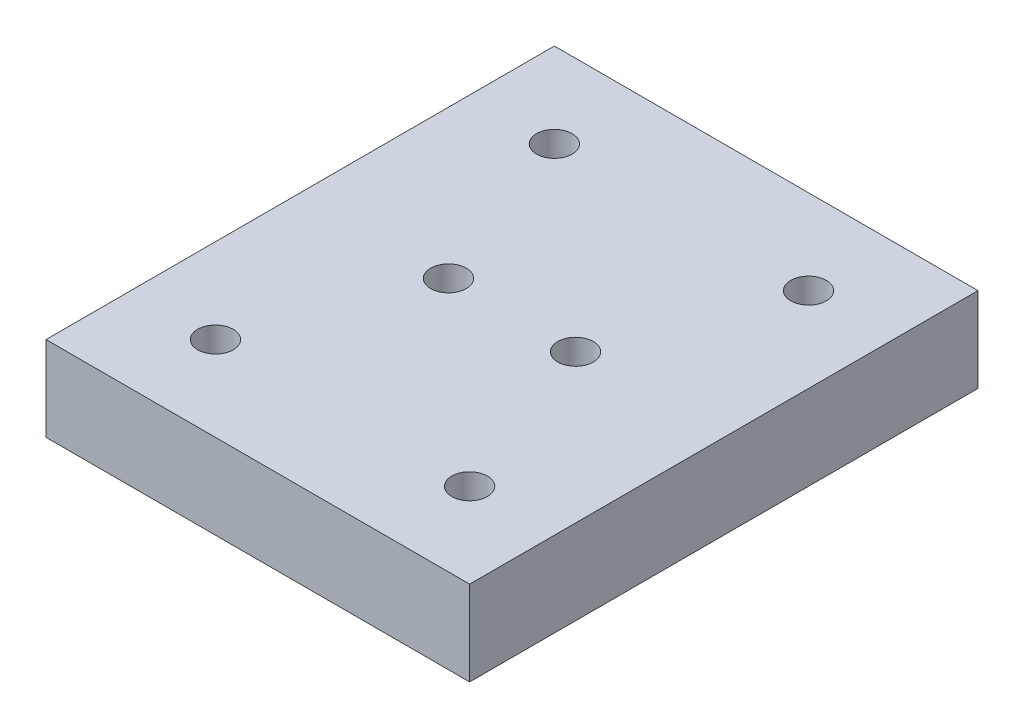
ISO-10303-21;
HEADER;
FILE_DESCRIPTION(('STEP AP214'),'2;1');
FILE_NAME('part.step','',(''),(''),'','','');
FILE_SCHEMA(('AUTOMOTIVE_DESIGN { 1 0 10303 214 1 1 1 1 }'));
ENDSEC;
DATA;
#1=APPLICATION_CONTEXT('core data for automotive mechanical design processes');
#2=APPLICATION_PROTOCOL_DEFINITION('international standard','automotive_design',2000,#1);
#3=PRODUCT_CONTEXT('',#1,'mechanical');
#4=PRODUCT('Part','Part','',(#3));
#5=PRODUCT_RELATED_PRODUCT_CATEGORY('part','',(#4));
#6=PRODUCT_DEFINITION_FORMATION('','',#4);
#7=PRODUCT_DEFINITION_CONTEXT('part definition',#1,'design');
#8=PRODUCT_DEFINITION('design','',#6,#7);
#9=PRODUCT_DEFINITION_SHAPE('','',#8);
#10=(LENGTH_UNIT() NAMED_UNIT(*) SI_UNIT(.MILLI.,.METRE.));
#11=(NAMED_UNIT(*) PLANE_ANGLE_UNIT() SI_UNIT($,.RADIAN.));
#12=(NAMED_UNIT(*) SI_UNIT($,.STERADIAN.) SOLID_ANGLE_UNIT());
#13=UNCERTAINTY_MEASURE_WITH_UNIT(LENGTH_MEASURE(1.E-05),#10,'distance_accuracy_value','');
#14=(GEOMETRIC_REPRESENTATION_CONTEXT(3) GLOBAL_UNCERTAINTY_ASSIGNED_CONTEXT((#13)) GLOBAL_UNIT_ASSIGNED_CONTEXT((#10,
#11,#12)) REPRESENTATION_CONTEXT('',''));
#15=CARTESIAN_POINT('',(0.,0.,0.));
#16=DIRECTION('',(0.,0.,1.));
#17=DIRECTION('',(1.,0.,0.));
#18=AXIS2_PLACEMENT_3D('',#15,#16,#17);
#19=CARTESIAN_POINT('',(25.,10.,30.));
#20=DIRECTION('',(-1.,0.,0.));
#21=DIRECTION('',(0.,0.,1.));
#22=AXIS2_PLACEMENT_3D('',#19,#20,#21);
#23=PLANE('',#22);
#24=DIRECTION('',(0.,0.,-1.));
#25=VECTOR('',#24,1.);
#26=CARTESIAN_POINT('',(25.,0.,30.));
#27=LINE('',#26,#25);
#28=CARTESIAN_POINT('',(25.,0.,30.));
#29=VERTEX_POINT('',#28);
#30=CARTESIAN_POINT('',(25.,0.,-30.));
#31=VERTEX_POINT('',#30);
#32=EDGE_CURVE('E97',#29,#31,#27,.T.);
#33=ORIENTED_EDGE('',*,*,#32,.T.);
#34=DIRECTION('',(0.,-1.,0.));
#35=VECTOR('',#34,1.);
#36=CARTESIAN_POINT('',(25.,10.,-30.));
#37=LINE('',#36,#35);
#38=CARTESIAN_POINT('',(25.,10.,-30.));
#39=VERTEX_POINT('',#38);
#40=EDGE_CURVE('E11',#39,#31,#37,.T.);
#41=ORIENTED_EDGE('',*,*,#40,.F.);
#42=DIRECTION('',(0.,0.,-1.));
#43=VECTOR('',#42,1.);
#44=CARTESIAN_POINT('',(25.,10.,30.));
#45=LINE('',#44,#43);
#46=CARTESIAN_POINT('',(25.,10.,30.));
#47=VERTEX_POINT('',#46);
#48=EDGE_CURVE('E85',#47,#39,#45,.T.);
#49=ORIENTED_EDGE('',*,*,#48,.F.);
#50=DIRECTION('',(0.,-1.,0.));
#51=VECTOR('',#50,1.);
#52=CARTESIAN_POINT('',(25.,10.,30.));
#53=LINE('',#52,#51);
#54=EDGE_CURVE('E93',#47,#29,#53,.T.);
#55=ORIENTED_EDGE('',*,*,#54,.T.);
#56=EDGE_LOOP('',(#33,#41,#49,#55));
#57=FACE_BOUND('',#56,.T.);
#58=ADVANCED_FACE('F34',(#57),#23,.F.);
#59=CARTESIAN_POINT('',(-25.,10.,-30.));
#60=DIRECTION('',(0.,0.,1.));
#61=DIRECTION('',(1.,0.,0.));
#62=AXIS2_PLACEMENT_3D('',#59,#60,#61);
#63=PLANE('',#62);
#64=DIRECTION('',(-1.,0.,0.));
#65=VECTOR('',#64,1.);
#66=CARTESIAN_POINT('',(-25.,0.,-30.));
#67=LINE('',#66,#65);
#68=CARTESIAN_POINT('',(-25.,0.,-30.));
#69=VERTEX_POINT('',#68);
#70=EDGE_CURVE('E89',#31,#69,#67,.T.);
#71=ORIENTED_EDGE('',*,*,#70,.T.);
#72=DIRECTION('',(0.,-1.,0.));
#73=VECTOR('',#72,1.);
#74=CARTESIAN_POINT('',(-25.,10.,-30.));
#75=LINE('',#74,#73);
#76=CARTESIAN_POINT('',(-25.,10.,-30.));
#77=VERTEX_POINT('',#76);
#78=EDGE_CURVE('E42',#77,#69,#75,.T.);
#79=ORIENTED_EDGE('',*,*,#78,.F.);
#80=DIRECTION('',(-1.,0.,0.));
#81=VECTOR('',#80,1.);
#82=CARTESIAN_POINT('',(-25.,10.,-30.));
#83=LINE('',#82,#81);
#84=EDGE_CURVE('E80',#39,#77,#83,.T.);
#85=ORIENTED_EDGE('',*,*,#84,.F.);
#86=ORIENTED_EDGE('',*,*,#40,.T.);
#87=EDGE_LOOP('',(#71,#79,#85,#86));
#88=FACE_BOUND('',#87,.T.);
#89=ADVANCED_FACE('F88',(#88),#63,.F.);
#90=CARTESIAN_POINT('',(-25.,10.,30.));
#91=DIRECTION('',(1.,0.,0.));
#92=DIRECTION('',(0.,0.,-1.));
#93=AXIS2_PLACEMENT_3D('',#90,#91,#92);
#94=PLANE('',#93);
#95=DIRECTION('',(0.,0.,1.));
#96=VECTOR('',#95,1.);
#97=CARTESIAN_POINT('',(-25.,0.,30.));
#98=LINE('',#97,#96);
#99=CARTESIAN_POINT('',(-25.,0.,30.));
#100=VERTEX_POINT('',#99);
#101=EDGE_CURVE('E67',#69,#100,#98,.T.);
#102=ORIENTED_EDGE('',*,*,#101,.T.);
#103=DIRECTION('',(0.,-1.,0.));
#104=VECTOR('',#103,1.);
#105=CARTESIAN_POINT('',(-25.,10.,30.));
#106=LINE('',#105,#104);
#107=CARTESIAN_POINT('',(-25.,10.,30.));
#108=VERTEX_POINT('',#107);
#109=EDGE_CURVE('E90',#108,#100,#106,.T.);
#110=ORIENTED_EDGE('',*,*,#109,.F.);
#111=DIRECTION('',(0.,0.,1.));
#112=VECTOR('',#111,1.);
#113=CARTESIAN_POINT('',(-25.,10.,30.));
#114=LINE('',#113,#112);
#115=EDGE_CURVE('E83',#77,#108,#114,.T.);
#116=ORIENTED_EDGE('',*,*,#115,.F.);
#117=ORIENTED_EDGE('',*,*,#78,.T.);
#118=EDGE_LOOP('',(#102,#110,#116,#117));
#119=FACE_BOUND('',#118,.T.);
#120=ADVANCED_FACE('F91',(#119),#94,.F.);
#121=CARTESIAN_POINT('',(-25.,10.,30.));
#122=DIRECTION('',(0.,0.,-1.));
#123=DIRECTION('',(-1.,0.,0.));
#124=AXIS2_PLACEMENT_3D('',#121,#122,#123);
#125=PLANE('',#124);
#126=DIRECTION('',(1.,0.,0.));
#127=VECTOR('',#126,1.);
#128=CARTESIAN_POINT('',(-25.,0.,30.));
#129=LINE('',#128,#127);
#130=EDGE_CURVE('E73',#100,#29,#129,.T.);
#131=ORIENTED_EDGE('',*,*,#130,.T.);
#132=ORIENTED_EDGE('',*,*,#54,.F.);
#133=DIRECTION('',(1.,0.,0.));
#134=VECTOR('',#133,1.);
#135=CARTESIAN_POINT('',(-25.,10.,30.));
#136=LINE('',#135,#134);
#137=EDGE_CURVE('E50',#108,#47,#136,.T.);
#138=ORIENTED_EDGE('',*,*,#137,.F.);
#139=ORIENTED_EDGE('',*,*,#109,.T.);
#140=EDGE_LOOP('',(#131,#132,#138,#139));
#141=FACE_BOUND('',#140,.T.);
#142=ADVANCED_FACE('F105',(#141),#125,.F.);
#143=CARTESIAN_POINT('',(0.,10.,0.));
#144=DIRECTION('',(0.,-1.,0.));
#145=DIRECTION('',(0.,0.,-1.));
#146=AXIS2_PLACEMENT_3D('',#143,#144,#145);
#147=PLANE('',#146);
#148=CARTESIAN_POINT('',(15.,10.,-20.));
#149=DIRECTION('',(0.,1.,0.));
#150=DIRECTION('',(0.,0.,1.));
#151=AXIS2_PLACEMENT_3D('',#148,#149,#150);
#152=CIRCLE('',#151,2.09999999999999);
#153=CARTESIAN_POINT('',(15.,10.,-17.9));
#154=VERTEX_POINT('',#153);
#155=EDGE_CURVE('E143',#154,#154,#152,.T.);
#156=ORIENTED_EDGE('',*,*,#155,.F.);
#157=EDGE_LOOP('',(#156));
#158=FACE_BOUND('',#157,.T.);
#159=CARTESIAN_POINT('',(-15.,10.,-20.));
#160=DIRECTION('',(0.,1.,0.));
#161=DIRECTION('',(0.,0.,1.));
#162=AXIS2_PLACEMENT_3D('',#159,#160,#161);
#163=CIRCLE('',#162,2.09999999999999);
#164=CARTESIAN_POINT('',(-15.,10.,-17.9));
#165=VERTEX_POINT('',#164);
#166=EDGE_CURVE('E137',#165,#165,#163,.T.);
#167=ORIENTED_EDGE('',*,*,#166,.F.);
#168=EDGE_LOOP('',(#167));
#169=FACE_BOUND('',#168,.T.);
#170=CARTESIAN_POINT('',(-15.,10.,20.));
#171=DIRECTION('',(0.,1.,0.));
#172=DIRECTION('',(0.,0.,1.));
#173=AXIS2_PLACEMENT_3D('',#170,#171,#172);
#174=CIRCLE('',#173,2.09999999999999);
#175=CARTESIAN_POINT('',(-15.,10.,22.1));
#176=VERTEX_POINT('',#175);
#177=EDGE_CURVE('E131',#176,#176,#174,.T.);
#178=ORIENTED_EDGE('',*,*,#177,.F.);
#179=EDGE_LOOP('',(#178));
#180=FACE_BOUND('',#179,.T.);
#181=CARTESIAN_POINT('',(15.,10.,20.));
#182=DIRECTION('',(0.,1.,0.));
#183=DIRECTION('',(0.,0.,1.));
#184=AXIS2_PLACEMENT_3D('',#181,#182,#183);
#185=CIRCLE('',#184,2.09999999999999);
#186=CARTESIAN_POINT('',(15.,10.,22.1));
#187=VERTEX_POINT('',#186);
#188=EDGE_CURVE('E125',#187,#187,#185,.T.);
#189=ORIENTED_EDGE('',*,*,#188,.F.);
#190=EDGE_LOOP('',(#189));
#191=FACE_BOUND('',#190,.T.);
#192=CARTESIAN_POINT('',(-7.5,10.,0.));
#193=DIRECTION('',(0.,1.,0.));
#194=DIRECTION('',(0.,0.,1.));
#195=AXIS2_PLACEMENT_3D('',#192,#193,#194);
#196=CIRCLE('',#195,2.09999999999999);
#197=CARTESIAN_POINT('',(-7.5,10.,2.09999999999999));
#198=VERTEX_POINT('',#197);
#199=EDGE_CURVE('E119',#198,#198,#196,.T.);
#200=ORIENTED_EDGE('',*,*,#199,.F.);
#201=EDGE_LOOP('',(#200));
#202=FACE_BOUND('',#201,.T.);
#203=CARTESIAN_POINT('',(7.5,10.,0.));
#204=DIRECTION('',(0.,1.,0.));
#205=DIRECTION('',(0.,0.,1.));
#206=AXIS2_PLACEMENT_3D('',#203,#204,#205);
#207=CIRCLE('',#206,2.09999999999999);
#208=CARTESIAN_POINT('',(7.5,10.,2.09999999999999));
#209=VERTEX_POINT('',#208);
#210=EDGE_CURVE('E113',#209,#209,#207,.T.);
#211=ORIENTED_EDGE('',*,*,#210,.F.);
#212=EDGE_LOOP('',(#211));
#213=FACE_BOUND('',#212,.T.);
#214=ORIENTED_EDGE('',*,*,#48,.T.);
#215=ORIENTED_EDGE('',*,*,#84,.T.);
#216=ORIENTED_EDGE('',*,*,#115,.T.);
#217=ORIENTED_EDGE('',*,*,#137,.T.);
#218=EDGE_LOOP('',(#214,#215,#216,#217));
#219=FACE_BOUND('',#218,.T.);
#220=ADVANCED_FACE('F81',(#158,#169,#180,#191,#202,#213,#219),#147,.F.);
#221=CARTESIAN_POINT('',(0.,0.,0.));
#222=DIRECTION('',(0.,-1.,0.));
#223=DIRECTION('',(0.,0.,-1.));
#224=AXIS2_PLACEMENT_3D('',#221,#222,#223);
#225=PLANE('',#224);
#226=CARTESIAN_POINT('',(15.,0.,-20.));
#227=DIRECTION('',(0.,1.,0.));
#228=DIRECTION('',(0.,0.,1.));
#229=AXIS2_PLACEMENT_3D('',#226,#227,#228);
#230=CIRCLE('',#229,2.1);
#231=CARTESIAN_POINT('',(15.,0.,-17.9));
#232=VERTEX_POINT('',#231);
#233=EDGE_CURVE('E140',#232,#232,#230,.T.);
#234=ORIENTED_EDGE('',*,*,#233,.T.);
#235=EDGE_LOOP('',(#234));
#236=FACE_BOUND('',#235,.T.);
#237=CARTESIAN_POINT('',(-15.,0.,-20.));
#238=DIRECTION('',(0.,1.,0.));
#239=DIRECTION('',(0.,0.,1.));
#240=AXIS2_PLACEMENT_3D('',#237,#238,#239);
#241=CIRCLE('',#240,2.1);
#242=CARTESIAN_POINT('',(-15.,0.,-17.9));
#243=VERTEX_POINT('',#242);
#244=EDGE_CURVE('E134',#243,#243,#241,.T.);
#245=ORIENTED_EDGE('',*,*,#244,.T.);
#246=EDGE_LOOP('',(#245));
#247=FACE_BOUND('',#246,.T.);
#248=CARTESIAN_POINT('',(-15.,0.,20.));
#249=DIRECTION('',(0.,1.,0.));
#250=DIRECTION('',(0.,0.,1.));
#251=AXIS2_PLACEMENT_3D('',#248,#249,#250);
#252=CIRCLE('',#251,2.1);
#253=CARTESIAN_POINT('',(-15.,0.,22.1));
#254=VERTEX_POINT('',#253);
#255=EDGE_CURVE('E128',#254,#254,#252,.T.);
#256=ORIENTED_EDGE('',*,*,#255,.T.);
#257=EDGE_LOOP('',(#256));
#258=FACE_BOUND('',#257,.T.);
#259=CARTESIAN_POINT('',(15.,0.,20.));
#260=DIRECTION('',(0.,1.,0.));
#261=DIRECTION('',(0.,0.,1.));
#262=AXIS2_PLACEMENT_3D('',#259,#260,#261);
#263=CIRCLE('',#262,2.1);
#264=CARTESIAN_POINT('',(15.,0.,22.1));
#265=VERTEX_POINT('',#264);
#266=EDGE_CURVE('E122',#265,#265,#263,.T.);
#267=ORIENTED_EDGE('',*,*,#266,.T.);
#268=EDGE_LOOP('',(#267));
#269=FACE_BOUND('',#268,.T.);
#270=CARTESIAN_POINT('',(-7.5,0.,0.));
#271=DIRECTION('',(0.,1.,0.));
#272=DIRECTION('',(0.,0.,1.));
#273=AXIS2_PLACEMENT_3D('',#270,#271,#272);
#274=CIRCLE('',#273,2.1);
#275=CARTESIAN_POINT('',(-7.5,0.,2.1));
#276=VERTEX_POINT('',#275);
#277=EDGE_CURVE('E116',#276,#276,#274,.T.);
#278=ORIENTED_EDGE('',*,*,#277,.T.);
#279=EDGE_LOOP('',(#278));
#280=FACE_BOUND('',#279,.T.);
#281=CARTESIAN_POINT('',(7.5,0.,0.));
#282=DIRECTION('',(0.,1.,0.));
#283=DIRECTION('',(0.,0.,1.));
#284=AXIS2_PLACEMENT_3D('',#281,#282,#283);
#285=CIRCLE('',#284,2.1);
#286=CARTESIAN_POINT('',(7.5,0.,2.1));
#287=VERTEX_POINT('',#286);
#288=EDGE_CURVE('E100',#287,#287,#285,.T.);
#289=ORIENTED_EDGE('',*,*,#288,.T.);
#290=EDGE_LOOP('',(#289));
#291=FACE_BOUND('',#290,.T.);
#292=ORIENTED_EDGE('',*,*,#32,.F.);
#293=ORIENTED_EDGE('',*,*,#130,.F.);
#294=ORIENTED_EDGE('',*,*,#101,.F.);
#295=ORIENTED_EDGE('',*,*,#70,.F.);
#296=EDGE_LOOP('',(#292,#293,#294,#295));
#297=FACE_BOUND('',#296,.T.);
#298=ADVANCED_FACE('F108',(#236,#247,#258,#269,#280,#291,#297),#225,.T.);
#299=CARTESIAN_POINT('',(7.5,10.,0.));
#300=DIRECTION('',(0.,1.,0.));
#301=DIRECTION('',(0.,0.,1.));
#302=AXIS2_PLACEMENT_3D('',#299,#300,#301);
#303=CYLINDRICAL_SURFACE('',#302,2.09999999999999);
#304=ORIENTED_EDGE('',*,*,#288,.F.);
#305=EDGE_LOOP('',(#304));
#306=FACE_BOUND('',#305,.T.);
#307=ORIENTED_EDGE('',*,*,#210,.T.);
#308=EDGE_LOOP('',(#307));
#309=FACE_BOUND('',#308,.T.);
#310=ADVANCED_FACE('F162',(#306,#309),#303,.F.);
#311=CARTESIAN_POINT('',(-7.5,10.,0.));
#312=DIRECTION('',(0.,1.,0.));
#313=DIRECTION('',(0.,0.,1.));
#314=AXIS2_PLACEMENT_3D('',#311,#312,#313);
#315=CYLINDRICAL_SURFACE('',#314,2.09999999999999);
#316=ORIENTED_EDGE('',*,*,#277,.F.);
#317=EDGE_LOOP('',(#316));
#318=FACE_BOUND('',#317,.T.);
#319=ORIENTED_EDGE('',*,*,#199,.T.);
#320=EDGE_LOOP('',(#319));
#321=FACE_BOUND('',#320,.T.);
#322=ADVANCED_FACE('F164',(#318,#321),#315,.F.);
#323=CARTESIAN_POINT('',(15.,10.,20.));
#324=DIRECTION('',(0.,1.,0.));
#325=DIRECTION('',(0.,0.,1.));
#326=AXIS2_PLACEMENT_3D('',#323,#324,#325);
#327=CYLINDRICAL_SURFACE('',#326,2.09999999999999);
#328=ORIENTED_EDGE('',*,*,#266,.F.);
#329=EDGE_LOOP('',(#328));
#330=FACE_BOUND('',#329,.T.);
#331=ORIENTED_EDGE('',*,*,#188,.T.);
#332=EDGE_LOOP('',(#331));
#333=FACE_BOUND('',#332,.T.);
#334=ADVANCED_FACE('F171',(#330,#333),#327,.F.);
#335=CARTESIAN_POINT('',(-15.,10.,20.));
#336=DIRECTION('',(0.,1.,0.));
#337=DIRECTION('',(0.,0.,1.));
#338=AXIS2_PLACEMENT_3D('',#335,#336,#337);
#339=CYLINDRICAL_SURFACE('',#338,2.09999999999999);
#340=ORIENTED_EDGE('',*,*,#255,.F.);
#341=EDGE_LOOP('',(#340));
#342=FACE_BOUND('',#341,.T.);
#343=ORIENTED_EDGE('',*,*,#177,.T.);
#344=EDGE_LOOP('',(#343));
#345=FACE_BOUND('',#344,.T.);
#346=ADVANCED_FACE('F212',(#342,#345),#339,.F.);
#347=CARTESIAN_POINT('',(-15.,10.,-20.));
#348=DIRECTION('',(0.,1.,0.));
#349=DIRECTION('',(0.,0.,1.));
#350=AXIS2_PLACEMENT_3D('',#347,#348,#349);
#351=CYLINDRICAL_SURFACE('',#350,2.09999999999999);
#352=ORIENTED_EDGE('',*,*,#244,.F.);
#353=EDGE_LOOP('',(#352));
#354=FACE_BOUND('',#353,.T.);
#355=ORIENTED_EDGE('',*,*,#166,.T.);
#356=EDGE_LOOP('',(#355));
#357=FACE_BOUND('',#356,.T.);
#358=ADVANCED_FACE('F224',(#354,#357),#351,.F.);
#359=CARTESIAN_POINT('',(15.,10.,-20.));
#360=DIRECTION('',(0.,1.,0.));
#361=DIRECTION('',(0.,0.,1.));
#362=AXIS2_PLACEMENT_3D('',#359,#360,#361);
#363=CYLINDRICAL_SURFACE('',#362,2.09999999999999);
#364=ORIENTED_EDGE('',*,*,#233,.F.);
#365=EDGE_LOOP('',(#364));
#366=FACE_BOUND('',#365,.T.);
#367=ORIENTED_EDGE('',*,*,#155,.T.);
#368=EDGE_LOOP('',(#367));
#369=FACE_BOUND('',#368,.T.);
#370=ADVANCED_FACE('F147',(#366,#369),#363,.F.);
#371=CLOSED_SHELL('',(#58,#89,#120,#142,#220,#298,#310,#322,#334,#346,#358,#370));
#372=MANIFOLD_SOLID_BREP('B2',#371);
#373=ADVANCED_BREP_SHAPE_REPRESENTATION('',(#18,#372),#14);
#374=SHAPE_DEFINITION_REPRESENTATION(#9,#373);
ENDSEC;
END-ISO-10303-21;
